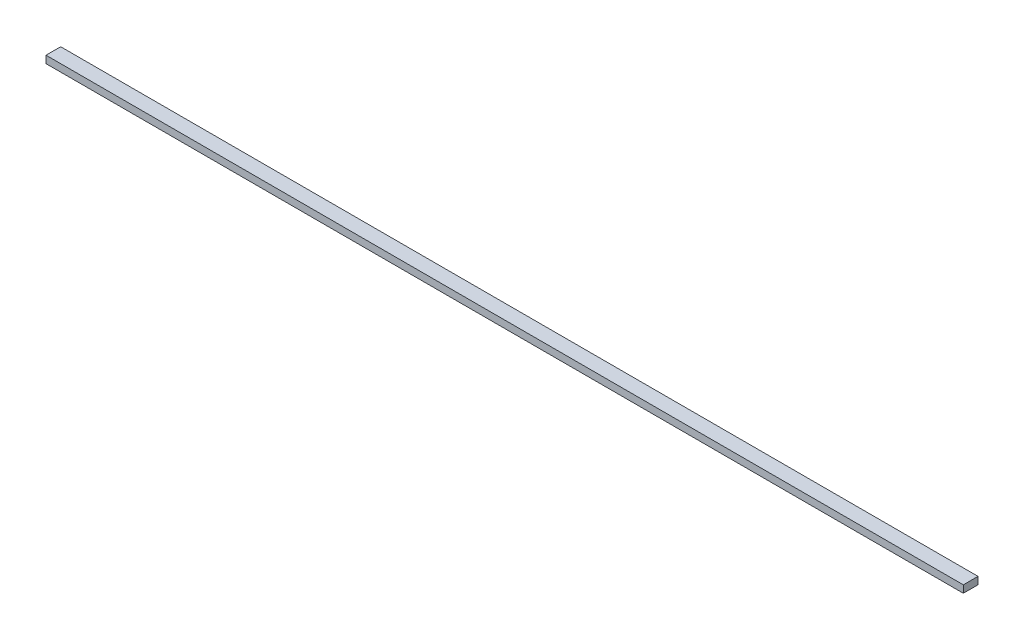
ISO-10303-21;
HEADER;
FILE_DESCRIPTION(('STEP AP214'),'2;1');
FILE_NAME('part.step','',(''),(''),'','','');
FILE_SCHEMA(('AUTOMOTIVE_DESIGN { 1 0 10303 214 1 1 1 1 }'));
ENDSEC;
DATA;
#1=APPLICATION_CONTEXT('core data for automotive mechanical design processes');
#2=APPLICATION_PROTOCOL_DEFINITION('international standard','automotive_design',2000,#1);
#3=PRODUCT_CONTEXT('',#1,'mechanical');
#4=PRODUCT('Part','Part','',(#3));
#5=PRODUCT_RELATED_PRODUCT_CATEGORY('part','',(#4));
#6=PRODUCT_DEFINITION_FORMATION('','',#4);
#7=PRODUCT_DEFINITION_CONTEXT('part definition',#1,'design');
#8=PRODUCT_DEFINITION('design','',#6,#7);
#9=PRODUCT_DEFINITION_SHAPE('','',#8);
#10=(LENGTH_UNIT() NAMED_UNIT(*) SI_UNIT(.MILLI.,.METRE.));
#11=(NAMED_UNIT(*) PLANE_ANGLE_UNIT() SI_UNIT($,.RADIAN.));
#12=(NAMED_UNIT(*) SI_UNIT($,.STERADIAN.) SOLID_ANGLE_UNIT());
#13=UNCERTAINTY_MEASURE_WITH_UNIT(LENGTH_MEASURE(1.E-05),#10,'distance_accuracy_value','');
#14=(GEOMETRIC_REPRESENTATION_CONTEXT(3) GLOBAL_UNCERTAINTY_ASSIGNED_CONTEXT((#13)) GLOBAL_UNIT_ASSIGNED_CONTEXT((#10,
#11,#12)) REPRESENTATION_CONTEXT('',''));
#15=CARTESIAN_POINT('',(0.,0.,0.));
#16=DIRECTION('',(0.,0.,1.));
#17=DIRECTION('',(1.,0.,0.));
#18=AXIS2_PLACEMENT_3D('',#15,#16,#17);
#19=CARTESIAN_POINT('',(-625.,10.,-9.99999999999998));
#20=DIRECTION('',(1.,0.,0.));
#21=DIRECTION('',(0.,0.,-1.));
#22=AXIS2_PLACEMENT_3D('',#19,#20,#21);
#23=PLANE('',#22);
#24=DIRECTION('',(0.,0.,1.));
#25=VECTOR('',#24,1.);
#26=CARTESIAN_POINT('',(-625.,0.,-9.99999999999998));
#27=LINE('',#26,#25);
#28=CARTESIAN_POINT('',(-625.,0.,-9.99999999999998));
#29=VERTEX_POINT('',#28);
#30=CARTESIAN_POINT('',(-625.,0.,10.));
#31=VERTEX_POINT('',#30);
#32=EDGE_CURVE('E97',#29,#31,#27,.T.);
#33=ORIENTED_EDGE('',*,*,#32,.T.);
#34=DIRECTION('',(0.,-1.,0.));
#35=VECTOR('',#34,1.);
#36=CARTESIAN_POINT('',(-625.,10.,10.));
#37=LINE('',#36,#35);
#38=CARTESIAN_POINT('',(-625.,10.,10.));
#39=VERTEX_POINT('',#38);
#40=EDGE_CURVE('E11',#39,#31,#37,.T.);
#41=ORIENTED_EDGE('',*,*,#40,.F.);
#42=DIRECTION('',(0.,0.,1.));
#43=VECTOR('',#42,1.);
#44=CARTESIAN_POINT('',(-625.,10.,-9.99999999999998));
#45=LINE('',#44,#43);
#46=CARTESIAN_POINT('',(-625.,10.,-9.99999999999998));
#47=VERTEX_POINT('',#46);
#48=EDGE_CURVE('E85',#47,#39,#45,.T.);
#49=ORIENTED_EDGE('',*,*,#48,.F.);
#50=DIRECTION('',(0.,-1.,0.));
#51=VECTOR('',#50,1.);
#52=CARTESIAN_POINT('',(-625.,10.,-9.99999999999998));
#53=LINE('',#52,#51);
#54=EDGE_CURVE('E93',#47,#29,#53,.T.);
#55=ORIENTED_EDGE('',*,*,#54,.T.);
#56=EDGE_LOOP('',(#33,#41,#49,#55));
#57=FACE_BOUND('',#56,.T.);
#58=ADVANCED_FACE('F34',(#57),#23,.F.);
#59=CARTESIAN_POINT('',(-625.,10.,10.));
#60=DIRECTION('',(0.,0.,-1.));
#61=DIRECTION('',(-1.,0.,0.));
#62=AXIS2_PLACEMENT_3D('',#59,#60,#61);
#63=PLANE('',#62);
#64=DIRECTION('',(1.,0.,0.));
#65=VECTOR('',#64,1.);
#66=CARTESIAN_POINT('',(-625.,0.,10.));
#67=LINE('',#66,#65);
#68=CARTESIAN_POINT('',(625.,0.,10.));
#69=VERTEX_POINT('',#68);
#70=EDGE_CURVE('E89',#31,#69,#67,.T.);
#71=ORIENTED_EDGE('',*,*,#70,.T.);
#72=DIRECTION('',(0.,-1.,0.));
#73=VECTOR('',#72,1.);
#74=CARTESIAN_POINT('',(625.,10.,10.));
#75=LINE('',#74,#73);
#76=CARTESIAN_POINT('',(625.,10.,10.));
#77=VERTEX_POINT('',#76);
#78=EDGE_CURVE('E42',#77,#69,#75,.T.);
#79=ORIENTED_EDGE('',*,*,#78,.F.);
#80=DIRECTION('',(1.,0.,0.));
#81=VECTOR('',#80,1.);
#82=CARTESIAN_POINT('',(-625.,10.,10.));
#83=LINE('',#82,#81);
#84=EDGE_CURVE('E80',#39,#77,#83,.T.);
#85=ORIENTED_EDGE('',*,*,#84,.F.);
#86=ORIENTED_EDGE('',*,*,#40,.T.);
#87=EDGE_LOOP('',(#71,#79,#85,#86));
#88=FACE_BOUND('',#87,.T.);
#89=ADVANCED_FACE('F88',(#88),#63,.F.);
#90=CARTESIAN_POINT('',(625.,10.,-9.99999999999998));
#91=DIRECTION('',(-1.,0.,0.));
#92=DIRECTION('',(0.,0.,1.));
#93=AXIS2_PLACEMENT_3D('',#90,#91,#92);
#94=PLANE('',#93);
#95=DIRECTION('',(0.,0.,-1.));
#96=VECTOR('',#95,1.);
#97=CARTESIAN_POINT('',(625.,0.,-9.99999999999998));
#98=LINE('',#97,#96);
#99=CARTESIAN_POINT('',(625.,0.,-9.99999999999998));
#100=VERTEX_POINT('',#99);
#101=EDGE_CURVE('E67',#69,#100,#98,.T.);
#102=ORIENTED_EDGE('',*,*,#101,.T.);
#103=DIRECTION('',(0.,-1.,0.));
#104=VECTOR('',#103,1.);
#105=CARTESIAN_POINT('',(625.,10.,-9.99999999999998));
#106=LINE('',#105,#104);
#107=CARTESIAN_POINT('',(625.,10.,-9.99999999999998));
#108=VERTEX_POINT('',#107);
#109=EDGE_CURVE('E90',#108,#100,#106,.T.);
#110=ORIENTED_EDGE('',*,*,#109,.F.);
#111=DIRECTION('',(0.,0.,-1.));
#112=VECTOR('',#111,1.);
#113=CARTESIAN_POINT('',(625.,10.,-9.99999999999998));
#114=LINE('',#113,#112);
#115=EDGE_CURVE('E83',#77,#108,#114,.T.);
#116=ORIENTED_EDGE('',*,*,#115,.F.);
#117=ORIENTED_EDGE('',*,*,#78,.T.);
#118=EDGE_LOOP('',(#102,#110,#116,#117));
#119=FACE_BOUND('',#118,.T.);
#120=ADVANCED_FACE('F91',(#119),#94,.F.);
#121=CARTESIAN_POINT('',(-625.,10.,-9.99999999999998));
#122=DIRECTION('',(0.,0.,1.));
#123=DIRECTION('',(1.,0.,0.));
#124=AXIS2_PLACEMENT_3D('',#121,#122,#123);
#125=PLANE('',#124);
#126=DIRECTION('',(-1.,0.,0.));
#127=VECTOR('',#126,1.);
#128=CARTESIAN_POINT('',(-625.,0.,-9.99999999999998));
#129=LINE('',#128,#127);
#130=EDGE_CURVE('E73',#100,#29,#129,.T.);
#131=ORIENTED_EDGE('',*,*,#130,.T.);
#132=ORIENTED_EDGE('',*,*,#54,.F.);
#133=DIRECTION('',(-1.,0.,0.));
#134=VECTOR('',#133,1.);
#135=CARTESIAN_POINT('',(-625.,10.,-9.99999999999998));
#136=LINE('',#135,#134);
#137=EDGE_CURVE('E50',#108,#47,#136,.T.);
#138=ORIENTED_EDGE('',*,*,#137,.F.);
#139=ORIENTED_EDGE('',*,*,#109,.T.);
#140=EDGE_LOOP('',(#131,#132,#138,#139));
#141=FACE_BOUND('',#140,.T.);
#142=ADVANCED_FACE('F104',(#141),#125,.F.);
#143=CARTESIAN_POINT('',(0.,10.,0.));
#144=DIRECTION('',(0.,1.,0.));
#145=DIRECTION('',(0.,0.,1.));
#146=AXIS2_PLACEMENT_3D('',#143,#144,#145);
#147=PLANE('',#146);
#148=ORIENTED_EDGE('',*,*,#48,.T.);
#149=ORIENTED_EDGE('',*,*,#84,.T.);
#150=ORIENTED_EDGE('',*,*,#115,.T.);
#151=ORIENTED_EDGE('',*,*,#137,.T.);
#152=EDGE_LOOP('',(#148,#149,#150,#151));
#153=FACE_BOUND('',#152,.T.);
#154=ADVANCED_FACE('F81',(#153),#147,.T.);
#155=CARTESIAN_POINT('',(0.,0.,0.));
#156=DIRECTION('',(0.,1.,0.));
#157=DIRECTION('',(0.,0.,1.));
#158=AXIS2_PLACEMENT_3D('',#155,#156,#157);
#159=PLANE('',#158);
#160=ORIENTED_EDGE('',*,*,#32,.F.);
#161=ORIENTED_EDGE('',*,*,#130,.F.);
#162=ORIENTED_EDGE('',*,*,#101,.F.);
#163=ORIENTED_EDGE('',*,*,#70,.F.);
#164=EDGE_LOOP('',(#160,#161,#162,#163));
#165=FACE_BOUND('',#164,.T.);
#166=ADVANCED_FACE('F107',(#165),#159,.F.);
#167=CLOSED_SHELL('',(#58,#89,#120,#142,#154,#166));
#168=MANIFOLD_SOLID_BREP('B2',#167);
#169=ADVANCED_BREP_SHAPE_REPRESENTATION('',(#18,#168),#14);
#170=SHAPE_DEFINITION_REPRESENTATION(#9,#169);
ENDSEC;
END-ISO-10303-21;
